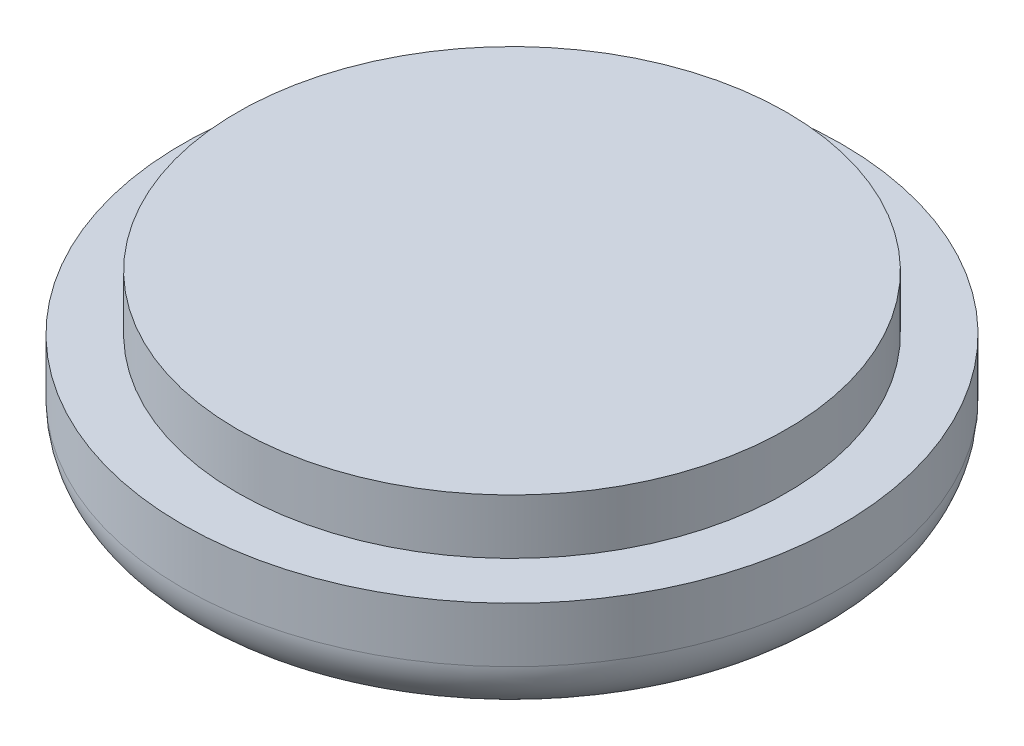
ISO-10303-21;
HEADER;
FILE_DESCRIPTION(('STEP AP214'),'2;1');
FILE_NAME('part.step','',(''),(''),'','','');
FILE_SCHEMA(('AUTOMOTIVE_DESIGN { 1 0 10303 214 1 1 1 1 }'));
ENDSEC;
DATA;
#1=APPLICATION_CONTEXT('core data for automotive mechanical design processes');
#2=APPLICATION_PROTOCOL_DEFINITION('international standard','automotive_design',2000,#1);
#3=PRODUCT_CONTEXT('',#1,'mechanical');
#4=PRODUCT('Part','Part','',(#3));
#5=PRODUCT_RELATED_PRODUCT_CATEGORY('part','',(#4));
#6=PRODUCT_DEFINITION_FORMATION('','',#4);
#7=PRODUCT_DEFINITION_CONTEXT('part definition',#1,'design');
#8=PRODUCT_DEFINITION('design','',#6,#7);
#9=PRODUCT_DEFINITION_SHAPE('','',#8);
#10=(LENGTH_UNIT() NAMED_UNIT(*) SI_UNIT(.MILLI.,.METRE.));
#11=(NAMED_UNIT(*) PLANE_ANGLE_UNIT() SI_UNIT($,.RADIAN.));
#12=(NAMED_UNIT(*) SI_UNIT($,.STERADIAN.) SOLID_ANGLE_UNIT());
#13=UNCERTAINTY_MEASURE_WITH_UNIT(LENGTH_MEASURE(1.E-05),#10,'distance_accuracy_value','');
#14=(GEOMETRIC_REPRESENTATION_CONTEXT(3) GLOBAL_UNCERTAINTY_ASSIGNED_CONTEXT((#13)) GLOBAL_UNIT_ASSIGNED_CONTEXT((#10,
#11,#12)) REPRESENTATION_CONTEXT('',''));
#15=CARTESIAN_POINT('',(0.,0.,0.));
#16=DIRECTION('',(0.,0.,1.));
#17=DIRECTION('',(1.,0.,0.));
#18=AXIS2_PLACEMENT_3D('',#15,#16,#17);
#19=CARTESIAN_POINT('',(0.,20.,0.));
#20=DIRECTION('',(0.,-1.,0.));
#21=DIRECTION('',(0.,0.,-1.));
#22=AXIS2_PLACEMENT_3D('',#19,#20,#21);
#23=CYLINDRICAL_SURFACE('',#22,60.);
#24=CARTESIAN_POINT('',(0.,10.,0.));
#25=DIRECTION('',(0.,1.,0.));
#26=DIRECTION('',(0.,0.,1.));
#27=AXIS2_PLACEMENT_3D('',#24,#25,#26);
#28=CIRCLE('',#27,60.);
#29=CARTESIAN_POINT('',(0.,10.,60.));
#30=VERTEX_POINT('',#29);
#31=EDGE_CURVE('E37',#30,#30,#28,.T.);
#32=ORIENTED_EDGE('',*,*,#31,.T.);
#33=EDGE_LOOP('',(#32));
#34=FACE_BOUND('',#33,.T.);
#35=CARTESIAN_POINT('',(0.,20.,0.));
#36=DIRECTION('',(0.,1.,0.));
#37=DIRECTION('',(0.,0.,1.));
#38=AXIS2_PLACEMENT_3D('',#35,#36,#37);
#39=CIRCLE('',#38,60.);
#40=CARTESIAN_POINT('',(0.,20.,60.));
#41=VERTEX_POINT('',#40);
#42=EDGE_CURVE('E45',#41,#41,#39,.T.);
#43=ORIENTED_EDGE('',*,*,#42,.F.);
#44=EDGE_LOOP('',(#43));
#45=FACE_BOUND('',#44,.T.);
#46=ADVANCED_FACE('F30',(#34,#45),#23,.T.);
#47=CARTESIAN_POINT('',(0.,20.,0.));
#48=DIRECTION('',(0.,1.,0.));
#49=DIRECTION('',(0.,0.,1.));
#50=AXIS2_PLACEMENT_3D('',#47,#48,#49);
#51=PLANE('',#50);
#52=CARTESIAN_POINT('',(0.,20.,0.));
#53=DIRECTION('',(0.,1.,0.));
#54=DIRECTION('',(0.,0.,1.));
#55=AXIS2_PLACEMENT_3D('',#52,#53,#54);
#56=CIRCLE('',#55,50.);
#57=CARTESIAN_POINT('',(0.,20.,50.));
#58=VERTEX_POINT('',#57);
#59=EDGE_CURVE('E41',#58,#58,#56,.T.);
#60=ORIENTED_EDGE('',*,*,#59,.F.);
#61=EDGE_LOOP('',(#60));
#62=FACE_BOUND('',#61,.T.);
#63=ORIENTED_EDGE('',*,*,#42,.T.);
#64=EDGE_LOOP('',(#63));
#65=FACE_BOUND('',#64,.T.);
#66=ADVANCED_FACE('F63',(#62,#65),#51,.T.);
#67=CARTESIAN_POINT('',(0.,0.,0.));
#68=DIRECTION('',(0.,1.,0.));
#69=DIRECTION('',(0.,0.,1.));
#70=AXIS2_PLACEMENT_3D('',#67,#68,#69);
#71=PLANE('',#70);
#72=CARTESIAN_POINT('',(0.,0.,0.));
#73=DIRECTION('',(0.,1.,0.));
#74=DIRECTION('',(0.,0.,1.));
#75=AXIS2_PLACEMENT_3D('',#72,#73,#74);
#76=CIRCLE('',#75,50.);
#77=CARTESIAN_POINT('',(0.,0.,50.));
#78=VERTEX_POINT('',#77);
#79=EDGE_CURVE('E10',#78,#78,#76,.F.);
#80=ORIENTED_EDGE('',*,*,#79,.T.);
#81=EDGE_LOOP('',(#80));
#82=FACE_BOUND('',#81,.T.);
#83=ADVANCED_FACE('F59',(#82),#71,.F.);
#84=CARTESIAN_POINT('',(0.,30.,0.));
#85=DIRECTION('',(0.,-1.,0.));
#86=DIRECTION('',(0.,0.,-1.));
#87=AXIS2_PLACEMENT_3D('',#84,#85,#86);
#88=CYLINDRICAL_SURFACE('',#87,50.);
#89=CARTESIAN_POINT('',(0.,30.,0.));
#90=DIRECTION('',(0.,1.,0.));
#91=DIRECTION('',(0.,0.,1.));
#92=AXIS2_PLACEMENT_3D('',#89,#90,#91);
#93=CIRCLE('',#92,50.);
#94=CARTESIAN_POINT('',(0.,30.,50.));
#95=VERTEX_POINT('',#94);
#96=EDGE_CURVE('E49',#95,#95,#93,.T.);
#97=ORIENTED_EDGE('',*,*,#96,.F.);
#98=EDGE_LOOP('',(#97));
#99=FACE_BOUND('',#98,.T.);
#100=ORIENTED_EDGE('',*,*,#59,.T.);
#101=EDGE_LOOP('',(#100));
#102=FACE_BOUND('',#101,.T.);
#103=ADVANCED_FACE('F56',(#99,#102),#88,.T.);
#104=CARTESIAN_POINT('',(0.,30.,0.));
#105=DIRECTION('',(0.,1.,0.));
#106=DIRECTION('',(0.,0.,1.));
#107=AXIS2_PLACEMENT_3D('',#104,#105,#106);
#108=PLANE('',#107);
#109=ORIENTED_EDGE('',*,*,#96,.T.);
#110=EDGE_LOOP('',(#109));
#111=FACE_BOUND('',#110,.T.);
#112=ADVANCED_FACE('F54',(#111),#108,.T.);
#113=CARTESIAN_POINT('',(0.,10.,0.));
#114=DIRECTION('',(0.,1.,0.));
#115=DIRECTION('',(0.,0.,1.));
#116=AXIS2_PLACEMENT_3D('',#113,#114,#115);
#117=TOROIDAL_SURFACE('',#116,50.,10.);
#118=ORIENTED_EDGE('',*,*,#79,.F.);
#119=EDGE_LOOP('',(#118));
#120=FACE_BOUND('',#119,.T.);
#121=ORIENTED_EDGE('',*,*,#31,.F.);
#122=EDGE_LOOP('',(#121));
#123=FACE_BOUND('',#122,.T.);
#124=ADVANCED_FACE('F32',(#120,#123),#117,.T.);
#125=CLOSED_SHELL('',(#46,#66,#83,#103,#112,#124));
#126=MANIFOLD_SOLID_BREP('B2',#125);
#127=ADVANCED_BREP_SHAPE_REPRESENTATION('',(#18,#126),#14);
#128=SHAPE_DEFINITION_REPRESENTATION(#9,#127);
ENDSEC;
END-ISO-10303-21;
